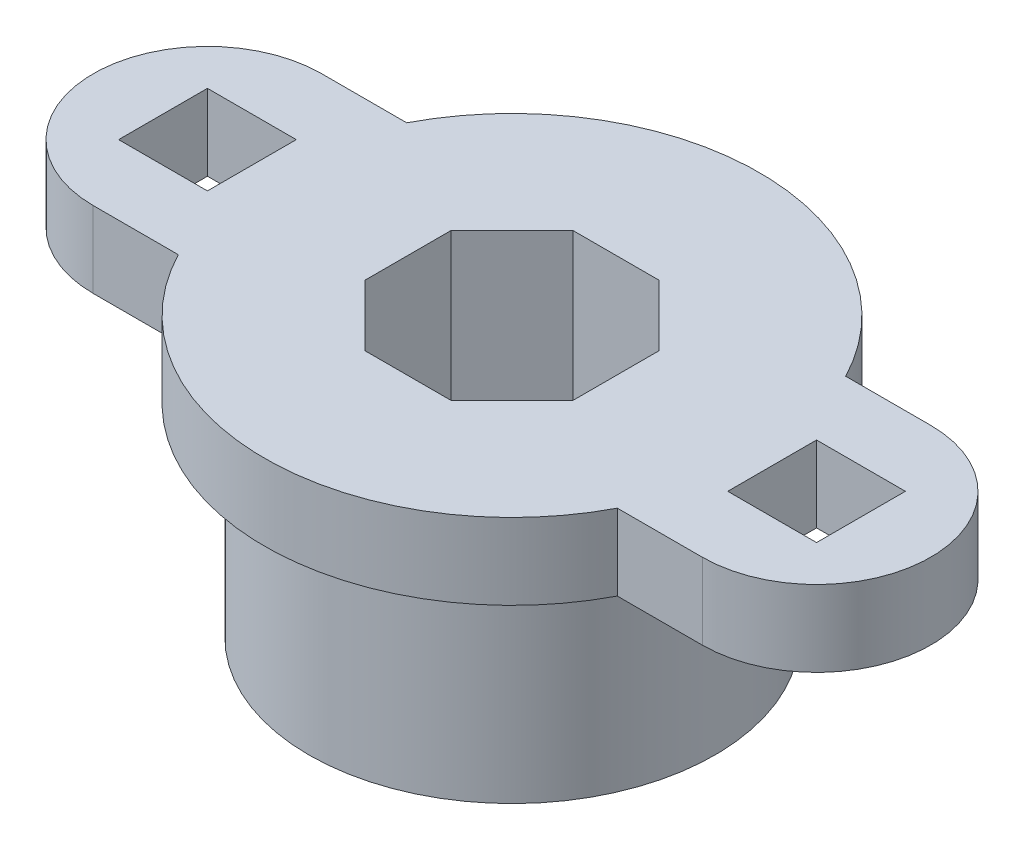
ISO-10303-21;
HEADER;
FILE_DESCRIPTION(('STEP AP214'),'2;1');
FILE_NAME('part.step','',(''),(''),'','','');
FILE_SCHEMA(('AUTOMOTIVE_DESIGN { 1 0 10303 214 1 1 1 1 }'));
ENDSEC;
DATA;
#1=APPLICATION_CONTEXT('core data for automotive mechanical design processes');
#2=APPLICATION_PROTOCOL_DEFINITION('international standard','automotive_design',2000,#1);
#3=PRODUCT_CONTEXT('',#1,'mechanical');
#4=PRODUCT('Part','Part','',(#3));
#5=PRODUCT_RELATED_PRODUCT_CATEGORY('part','',(#4));
#6=PRODUCT_DEFINITION_FORMATION('','',#4);
#7=PRODUCT_DEFINITION_CONTEXT('part definition',#1,'design');
#8=PRODUCT_DEFINITION('design','',#6,#7);
#9=PRODUCT_DEFINITION_SHAPE('','',#8);
#10=(LENGTH_UNIT() NAMED_UNIT(*) SI_UNIT(.MILLI.,.METRE.));
#11=(NAMED_UNIT(*) PLANE_ANGLE_UNIT() SI_UNIT($,.RADIAN.));
#12=(NAMED_UNIT(*) SI_UNIT($,.STERADIAN.) SOLID_ANGLE_UNIT());
#13=UNCERTAINTY_MEASURE_WITH_UNIT(LENGTH_MEASURE(1.E-05),#10,'distance_accuracy_value','');
#14=(GEOMETRIC_REPRESENTATION_CONTEXT(3) GLOBAL_UNCERTAINTY_ASSIGNED_CONTEXT((#13)) GLOBAL_UNIT_ASSIGNED_CONTEXT((#10,
#11,#12)) REPRESENTATION_CONTEXT('',''));
#15=CARTESIAN_POINT('',(0.,0.,0.));
#16=DIRECTION('',(0.,0.,1.));
#17=DIRECTION('',(1.,0.,0.));
#18=AXIS2_PLACEMENT_3D('',#15,#16,#17);
#19=CARTESIAN_POINT('',(0.,11.,0.));
#20=DIRECTION('',(0.,-1.,0.));
#21=DIRECTION('',(0.,0.,-1.));
#22=AXIS2_PLACEMENT_3D('',#19,#20,#21);
#23=CYLINDRICAL_SURFACE('',#22,9.75);
#24=CARTESIAN_POINT('',(0.,11.,0.));
#25=DIRECTION('',(0.,1.,0.));
#26=DIRECTION('',(0.,0.,1.));
#27=AXIS2_PLACEMENT_3D('',#24,#25,#26);
#28=CIRCLE('',#27,9.75);
#29=CARTESIAN_POINT('',(-8.6494219460031,11.,4.5));
#30=VERTEX_POINT('',#29);
#31=CARTESIAN_POINT('',(8.6494219460031,11.,4.5));
#32=VERTEX_POINT('',#31);
#33=EDGE_CURVE('E371',#30,#32,#28,.T.);
#34=ORIENTED_EDGE('',*,*,#33,.F.);
#35=DIRECTION('',(0.,-1.,0.));
#36=VECTOR('',#35,1.);
#37=CARTESIAN_POINT('',(-8.6494219460031,11.,4.5));
#38=LINE('',#37,#36);
#39=CARTESIAN_POINT('',(-8.6494219460031,8.,4.5));
#40=VERTEX_POINT('',#39);
#41=EDGE_CURVE('E367',#30,#40,#38,.T.);
#42=ORIENTED_EDGE('',*,*,#41,.T.);
#43=CARTESIAN_POINT('',(0.,8.,0.));
#44=DIRECTION('',(0.,1.,0.));
#45=DIRECTION('',(0.,0.,1.));
#46=AXIS2_PLACEMENT_3D('',#43,#44,#45);
#47=CIRCLE('',#46,9.75);
#48=CARTESIAN_POINT('',(8.6494219460031,8.,4.5));
#49=VERTEX_POINT('',#48);
#50=EDGE_CURVE('E370',#40,#49,#47,.T.);
#51=ORIENTED_EDGE('',*,*,#50,.T.);
#52=DIRECTION('',(0.,-1.,0.));
#53=VECTOR('',#52,1.);
#54=CARTESIAN_POINT('',(8.6494219460031,11.,4.5));
#55=LINE('',#54,#53);
#56=EDGE_CURVE('E365',#49,#32,#55,.F.);
#57=ORIENTED_EDGE('',*,*,#56,.T.);
#58=EDGE_LOOP('',(#34,#42,#51,#57));
#59=FACE_BOUND('',#58,.T.);
#60=ADVANCED_FACE('F33',(#59),#23,.T.);
#61=CARTESIAN_POINT('',(0.,8.,0.));
#62=DIRECTION('',(0.,-1.,0.));
#63=DIRECTION('',(0.,0.,-1.));
#64=AXIS2_PLACEMENT_3D('',#61,#62,#63);
#65=CYLINDRICAL_SURFACE('',#64,8.);
#66=CARTESIAN_POINT('',(0.,8.,0.));
#67=DIRECTION('',(0.,1.,0.));
#68=DIRECTION('',(0.,0.,1.));
#69=AXIS2_PLACEMENT_3D('',#66,#67,#68);
#70=CIRCLE('',#69,8.);
#71=CARTESIAN_POINT('',(0.,8.,8.));
#72=VERTEX_POINT('',#71);
#73=EDGE_CURVE('E11',#72,#72,#70,.T.);
#74=ORIENTED_EDGE('',*,*,#73,.F.);
#75=EDGE_LOOP('',(#74));
#76=FACE_BOUND('',#75,.T.);
#77=CARTESIAN_POINT('',(0.,0.,0.));
#78=DIRECTION('',(0.,1.,0.));
#79=DIRECTION('',(0.,0.,1.));
#80=AXIS2_PLACEMENT_3D('',#77,#78,#79);
#81=CIRCLE('',#80,8.);
#82=CARTESIAN_POINT('',(0.,0.,8.));
#83=VERTEX_POINT('',#82);
#84=EDGE_CURVE('E37',#83,#83,#81,.T.);
#85=ORIENTED_EDGE('',*,*,#84,.T.);
#86=EDGE_LOOP('',(#85));
#87=FACE_BOUND('',#86,.T.);
#88=ADVANCED_FACE('F35',(#76,#87),#65,.T.);
#89=CARTESIAN_POINT('',(0.,0.,0.));
#90=DIRECTION('',(0.,1.,0.));
#91=DIRECTION('',(0.,0.,1.));
#92=AXIS2_PLACEMENT_3D('',#89,#90,#91);
#93=PLANE('',#92);
#94=DIRECTION('',(0.707106781186547,0.,-0.707106781186548));
#95=VECTOR('',#94,1.);
#96=CARTESIAN_POINT('',(1.69827560572969,0.,4.1));
#97=LINE('',#96,#95);
#98=CARTESIAN_POINT('',(1.69827560572969,0.,4.1));
#99=VERTEX_POINT('',#98);
#100=CARTESIAN_POINT('',(4.1,0.,1.69827560572969));
#101=VERTEX_POINT('',#100);
#102=EDGE_CURVE('E202',#99,#101,#97,.T.);
#103=ORIENTED_EDGE('',*,*,#102,.T.);
#104=DIRECTION('',(0.,0.,-1.));
#105=VECTOR('',#104,1.);
#106=CARTESIAN_POINT('',(4.1,0.,1.69827560572969));
#107=LINE('',#106,#105);
#108=CARTESIAN_POINT('',(4.1,0.,-1.69827560572969));
#109=VERTEX_POINT('',#108);
#110=EDGE_CURVE('E196',#101,#109,#107,.T.);
#111=ORIENTED_EDGE('',*,*,#110,.T.);
#112=DIRECTION('',(-0.707106781186548,0.,-0.707106781186547));
#113=VECTOR('',#112,1.);
#114=CARTESIAN_POINT('',(4.1,0.,-1.69827560572969));
#115=LINE('',#114,#113);
#116=CARTESIAN_POINT('',(1.69827560572969,0.,-4.1));
#117=VERTEX_POINT('',#116);
#118=EDGE_CURVE('E205',#109,#117,#115,.T.);
#119=ORIENTED_EDGE('',*,*,#118,.T.);
#120=DIRECTION('',(-1.,0.,0.));
#121=VECTOR('',#120,1.);
#122=CARTESIAN_POINT('',(1.69827560572969,0.,-4.1));
#123=LINE('',#122,#121);
#124=CARTESIAN_POINT('',(-1.69827560572969,0.,-4.1));
#125=VERTEX_POINT('',#124);
#126=EDGE_CURVE('E48',#117,#125,#123,.T.);
#127=ORIENTED_EDGE('',*,*,#126,.T.);
#128=DIRECTION('',(-0.707106781186547,0.,0.707106781186548));
#129=VECTOR('',#128,1.);
#130=CARTESIAN_POINT('',(-1.69827560572969,0.,-4.1));
#131=LINE('',#130,#129);
#132=CARTESIAN_POINT('',(-4.1,0.,-1.69827560572969));
#133=VERTEX_POINT('',#132);
#134=EDGE_CURVE('E220',#125,#133,#131,.T.);
#135=ORIENTED_EDGE('',*,*,#134,.T.);
#136=DIRECTION('',(0.,0.,1.));
#137=VECTOR('',#136,1.);
#138=CARTESIAN_POINT('',(-4.1,0.,-1.69827560572969));
#139=LINE('',#138,#137);
#140=CARTESIAN_POINT('',(-4.1,0.,1.69827560572969));
#141=VERTEX_POINT('',#140);
#142=EDGE_CURVE('E223',#133,#141,#139,.T.);
#143=ORIENTED_EDGE('',*,*,#142,.T.);
#144=DIRECTION('',(0.707106781186548,0.,0.707106781186547));
#145=VECTOR('',#144,1.);
#146=CARTESIAN_POINT('',(-4.1,0.,1.69827560572969));
#147=LINE('',#146,#145);
#148=CARTESIAN_POINT('',(-1.69827560572969,0.,4.1));
#149=VERTEX_POINT('',#148);
#150=EDGE_CURVE('E226',#141,#149,#147,.T.);
#151=ORIENTED_EDGE('',*,*,#150,.T.);
#152=DIRECTION('',(1.,0.,0.));
#153=VECTOR('',#152,1.);
#154=CARTESIAN_POINT('',(-1.69827560572969,0.,4.1));
#155=LINE('',#154,#153);
#156=EDGE_CURVE('E229',#149,#99,#155,.T.);
#157=ORIENTED_EDGE('',*,*,#156,.T.);
#158=EDGE_LOOP('',(#103,#111,#119,#127,#135,#143,#151,#157));
#159=FACE_BOUND('',#158,.T.);
#160=ORIENTED_EDGE('',*,*,#84,.F.);
#161=EDGE_LOOP('',(#160));
#162=FACE_BOUND('',#161,.T.);
#163=ADVANCED_FACE('F209',(#159,#162),#93,.F.);
#164=CARTESIAN_POINT('',(0.,8.,0.));
#165=DIRECTION('',(0.,1.,0.));
#166=DIRECTION('',(0.,0.,1.));
#167=AXIS2_PLACEMENT_3D('',#164,#165,#166);
#168=PLANE('',#167);
#169=DIRECTION('',(0.,0.,1.));
#170=VECTOR('',#169,1.);
#171=CARTESIAN_POINT('',(13.75,8.,-1.75));
#172=LINE('',#171,#170);
#173=CARTESIAN_POINT('',(13.75,8.,-1.75));
#174=VERTEX_POINT('',#173);
#175=CARTESIAN_POINT('',(13.75,8.,1.75000000000001));
#176=VERTEX_POINT('',#175);
#177=EDGE_CURVE('E264',#174,#176,#172,.T.);
#178=ORIENTED_EDGE('',*,*,#177,.F.);
#179=DIRECTION('',(1.,0.,0.));
#180=VECTOR('',#179,1.);
#181=CARTESIAN_POINT('',(10.25,8.,-1.75));
#182=LINE('',#181,#180);
#183=CARTESIAN_POINT('',(10.25,8.,-1.75));
#184=VERTEX_POINT('',#183);
#185=EDGE_CURVE('E267',#184,#174,#182,.T.);
#186=ORIENTED_EDGE('',*,*,#185,.F.);
#187=DIRECTION('',(0.,0.,-1.));
#188=VECTOR('',#187,1.);
#189=CARTESIAN_POINT('',(10.25,8.,1.75000000000001));
#190=LINE('',#189,#188);
#191=CARTESIAN_POINT('',(10.25,8.,1.75000000000001));
#192=VERTEX_POINT('',#191);
#193=EDGE_CURVE('E284',#192,#184,#190,.T.);
#194=ORIENTED_EDGE('',*,*,#193,.F.);
#195=DIRECTION('',(-1.,0.,0.));
#196=VECTOR('',#195,1.);
#197=CARTESIAN_POINT('',(13.75,8.,1.75000000000001));
#198=LINE('',#197,#196);
#199=EDGE_CURVE('E251',#176,#192,#198,.T.);
#200=ORIENTED_EDGE('',*,*,#199,.F.);
#201=EDGE_LOOP('',(#178,#186,#194,#200));
#202=FACE_BOUND('',#201,.T.);
#203=DIRECTION('',(-1.,0.,0.));
#204=VECTOR('',#203,1.);
#205=CARTESIAN_POINT('',(-13.75,8.,1.75000000000001));
#206=LINE('',#205,#204);
#207=CARTESIAN_POINT('',(-10.25,8.,1.75000000000001));
#208=VERTEX_POINT('',#207);
#209=CARTESIAN_POINT('',(-13.75,8.,1.75000000000001));
#210=VERTEX_POINT('',#209);
#211=EDGE_CURVE('E295',#208,#210,#206,.T.);
#212=ORIENTED_EDGE('',*,*,#211,.F.);
#213=DIRECTION('',(0.,0.,1.));
#214=VECTOR('',#213,1.);
#215=CARTESIAN_POINT('',(-10.25,8.,1.75000000000001));
#216=LINE('',#215,#214);
#217=CARTESIAN_POINT('',(-10.25,8.,-1.75));
#218=VERTEX_POINT('',#217);
#219=EDGE_CURVE('E298',#218,#208,#216,.T.);
#220=ORIENTED_EDGE('',*,*,#219,.F.);
#221=DIRECTION('',(1.,0.,0.));
#222=VECTOR('',#221,1.);
#223=CARTESIAN_POINT('',(-10.25,8.,-1.75));
#224=LINE('',#223,#222);
#225=CARTESIAN_POINT('',(-13.75,8.,-1.75));
#226=VERTEX_POINT('',#225);
#227=EDGE_CURVE('E315',#226,#218,#224,.T.);
#228=ORIENTED_EDGE('',*,*,#227,.F.);
#229=DIRECTION('',(0.,0.,-1.));
#230=VECTOR('',#229,1.);
#231=CARTESIAN_POINT('',(-13.75,8.,-1.75));
#232=LINE('',#231,#230);
#233=EDGE_CURVE('E293',#210,#226,#232,.T.);
#234=ORIENTED_EDGE('',*,*,#233,.F.);
#235=EDGE_LOOP('',(#212,#220,#228,#234));
#236=FACE_BOUND('',#235,.T.);
#237=ORIENTED_EDGE('',*,*,#73,.T.);
#238=EDGE_LOOP('',(#237));
#239=FACE_BOUND('',#238,.T.);
#240=CARTESIAN_POINT('',(8.6494219460031,8.,-4.5));
#241=VERTEX_POINT('',#240);
#242=CARTESIAN_POINT('',(-8.6494219460031,8.,-4.5));
#243=VERTEX_POINT('',#242);
#244=EDGE_CURVE('E375',#241,#243,#47,.T.);
#245=ORIENTED_EDGE('',*,*,#244,.F.);
#246=DIRECTION('',(1.,0.,0.));
#247=VECTOR('',#246,1.);
#248=CARTESIAN_POINT('',(12.,8.,-4.5));
#249=LINE('',#248,#247);
#250=CARTESIAN_POINT('',(12.,8.,-4.5));
#251=VERTEX_POINT('',#250);
#252=EDGE_CURVE('E334',#241,#251,#249,.T.);
#253=ORIENTED_EDGE('',*,*,#252,.T.);
#254=CARTESIAN_POINT('',(12.,8.,0.));
#255=DIRECTION('',(0.,1.,0.));
#256=DIRECTION('',(0.,0.,1.));
#257=AXIS2_PLACEMENT_3D('',#254,#255,#256);
#258=CIRCLE('',#257,4.5);
#259=CARTESIAN_POINT('',(12.,8.,4.5));
#260=VERTEX_POINT('',#259);
#261=EDGE_CURVE('E332',#251,#260,#258,.F.);
#262=ORIENTED_EDGE('',*,*,#261,.T.);
#263=DIRECTION('',(-1.,0.,0.));
#264=VECTOR('',#263,1.);
#265=CARTESIAN_POINT('',(12.,8.,4.5));
#266=LINE('',#265,#264);
#267=EDGE_CURVE('E329',#260,#49,#266,.T.);
#268=ORIENTED_EDGE('',*,*,#267,.T.);
#269=ORIENTED_EDGE('',*,*,#50,.F.);
#270=CARTESIAN_POINT('',(-12.,8.,4.5));
#271=VERTEX_POINT('',#270);
#272=EDGE_CURVE('E327',#40,#271,#266,.T.);
#273=ORIENTED_EDGE('',*,*,#272,.T.);
#274=CARTESIAN_POINT('',(-12.,8.,0.));
#275=DIRECTION('',(0.,1.,0.));
#276=DIRECTION('',(0.,0.,1.));
#277=AXIS2_PLACEMENT_3D('',#274,#275,#276);
#278=CIRCLE('',#277,4.5);
#279=CARTESIAN_POINT('',(-12.,8.,-4.5));
#280=VERTEX_POINT('',#279);
#281=EDGE_CURVE('E325',#271,#280,#278,.F.);
#282=ORIENTED_EDGE('',*,*,#281,.T.);
#283=EDGE_CURVE('E357',#280,#243,#249,.T.);
#284=ORIENTED_EDGE('',*,*,#283,.T.);
#285=EDGE_LOOP('',(#245,#253,#262,#268,#269,#273,#282,#284));
#286=FACE_BOUND('',#285,.T.);
#287=ADVANCED_FACE('F389',(#202,#236,#239,#286),#168,.F.);
#288=CARTESIAN_POINT('',(8.6494219460031,11.,-4.5));
#289=VERTEX_POINT('',#288);
#290=CARTESIAN_POINT('',(-8.6494219460031,11.,-4.5));
#291=VERTEX_POINT('',#290);
#292=EDGE_CURVE('E374',#289,#291,#28,.T.);
#293=ORIENTED_EDGE('',*,*,#292,.F.);
#294=DIRECTION('',(0.,-1.,0.));
#295=VECTOR('',#294,1.);
#296=CARTESIAN_POINT('',(8.6494219460031,11.,-4.5));
#297=LINE('',#296,#295);
#298=EDGE_CURVE('E362',#289,#241,#297,.T.);
#299=ORIENTED_EDGE('',*,*,#298,.T.);
#300=ORIENTED_EDGE('',*,*,#244,.T.);
#301=DIRECTION('',(0.,-1.,0.));
#302=VECTOR('',#301,1.);
#303=CARTESIAN_POINT('',(-8.6494219460031,11.,-4.5));
#304=LINE('',#303,#302);
#305=EDGE_CURVE('E360',#243,#291,#304,.F.);
#306=ORIENTED_EDGE('',*,*,#305,.T.);
#307=EDGE_LOOP('',(#293,#299,#300,#306));
#308=FACE_BOUND('',#307,.T.);
#309=ADVANCED_FACE('F380',(#308),#23,.T.);
#310=CARTESIAN_POINT('',(0.,11.,0.));
#311=DIRECTION('',(0.,1.,0.));
#312=DIRECTION('',(0.,0.,1.));
#313=AXIS2_PLACEMENT_3D('',#310,#311,#312);
#314=PLANE('',#313);
#315=DIRECTION('',(0.,0.,-1.));
#316=VECTOR('',#315,1.);
#317=CARTESIAN_POINT('',(4.1,11.,1.69827560572969));
#318=LINE('',#317,#316);
#319=CARTESIAN_POINT('',(4.1,11.,1.69827560572969));
#320=VERTEX_POINT('',#319);
#321=CARTESIAN_POINT('',(4.1,11.,-1.69827560572969));
#322=VERTEX_POINT('',#321);
#323=EDGE_CURVE('E56',#320,#322,#318,.T.);
#324=ORIENTED_EDGE('',*,*,#323,.F.);
#325=DIRECTION('',(0.707106781186547,0.,-0.707106781186548));
#326=VECTOR('',#325,1.);
#327=CARTESIAN_POINT('',(1.69827560572969,11.,4.1));
#328=LINE('',#327,#326);
#329=CARTESIAN_POINT('',(1.69827560572969,11.,4.1));
#330=VERTEX_POINT('',#329);
#331=EDGE_CURVE('E213',#330,#320,#328,.T.);
#332=ORIENTED_EDGE('',*,*,#331,.F.);
#333=DIRECTION('',(1.,0.,0.));
#334=VECTOR('',#333,1.);
#335=CARTESIAN_POINT('',(-1.69827560572969,11.,4.1));
#336=LINE('',#335,#334);
#337=CARTESIAN_POINT('',(-1.69827560572969,11.,4.1));
#338=VERTEX_POINT('',#337);
#339=EDGE_CURVE('E216',#338,#330,#336,.T.);
#340=ORIENTED_EDGE('',*,*,#339,.F.);
#341=DIRECTION('',(0.707106781186548,0.,0.707106781186547));
#342=VECTOR('',#341,1.);
#343=CARTESIAN_POINT('',(-4.1,11.,1.69827560572969));
#344=LINE('',#343,#342);
#345=CARTESIAN_POINT('',(-4.1,11.,1.69827560572969));
#346=VERTEX_POINT('',#345);
#347=EDGE_CURVE('E244',#346,#338,#344,.T.);
#348=ORIENTED_EDGE('',*,*,#347,.F.);
#349=DIRECTION('',(0.,0.,1.));
#350=VECTOR('',#349,1.);
#351=CARTESIAN_POINT('',(-4.1,11.,-1.69827560572969));
#352=LINE('',#351,#350);
#353=CARTESIAN_POINT('',(-4.1,11.,-1.69827560572969));
#354=VERTEX_POINT('',#353);
#355=EDGE_CURVE('E241',#354,#346,#352,.T.);
#356=ORIENTED_EDGE('',*,*,#355,.F.);
#357=DIRECTION('',(-0.707106781186547,0.,0.707106781186548));
#358=VECTOR('',#357,1.);
#359=CARTESIAN_POINT('',(-1.69827560572969,11.,-4.1));
#360=LINE('',#359,#358);
#361=CARTESIAN_POINT('',(-1.69827560572969,11.,-4.1));
#362=VERTEX_POINT('',#361);
#363=EDGE_CURVE('E238',#362,#354,#360,.T.);
#364=ORIENTED_EDGE('',*,*,#363,.F.);
#365=DIRECTION('',(-1.,0.,0.));
#366=VECTOR('',#365,1.);
#367=CARTESIAN_POINT('',(1.69827560572969,11.,-4.1));
#368=LINE('',#367,#366);
#369=CARTESIAN_POINT('',(1.69827560572969,11.,-4.1));
#370=VERTEX_POINT('',#369);
#371=EDGE_CURVE('E235',#370,#362,#368,.T.);
#372=ORIENTED_EDGE('',*,*,#371,.F.);
#373=DIRECTION('',(-0.707106781186548,0.,-0.707106781186547));
#374=VECTOR('',#373,1.);
#375=CARTESIAN_POINT('',(4.1,11.,-1.69827560572969));
#376=LINE('',#375,#374);
#377=EDGE_CURVE('E233',#322,#370,#376,.T.);
#378=ORIENTED_EDGE('',*,*,#377,.F.);
#379=EDGE_LOOP('',(#324,#332,#340,#348,#356,#364,#372,#378));
#380=FACE_BOUND('',#379,.T.);
#381=DIRECTION('',(-1.,0.,0.));
#382=VECTOR('',#381,1.);
#383=CARTESIAN_POINT('',(10.25,11.,-1.75));
#384=LINE('',#383,#382);
#385=CARTESIAN_POINT('',(13.75,11.,-1.75));
#386=VERTEX_POINT('',#385);
#387=CARTESIAN_POINT('',(10.25,11.,-1.75));
#388=VERTEX_POINT('',#387);
#389=EDGE_CURVE('E270',#386,#388,#384,.T.);
#390=ORIENTED_EDGE('',*,*,#389,.F.);
#391=DIRECTION('',(0.,0.,-1.));
#392=VECTOR('',#391,1.);
#393=CARTESIAN_POINT('',(13.75,11.,-1.75));
#394=LINE('',#393,#392);
#395=CARTESIAN_POINT('',(13.75,11.,1.75000000000001));
#396=VERTEX_POINT('',#395);
#397=EDGE_CURVE('E278',#396,#386,#394,.T.);
#398=ORIENTED_EDGE('',*,*,#397,.F.);
#399=DIRECTION('',(1.,0.,0.));
#400=VECTOR('',#399,1.);
#401=CARTESIAN_POINT('',(13.75,11.,1.75000000000001));
#402=LINE('',#401,#400);
#403=CARTESIAN_POINT('',(10.25,11.,1.75000000000001));
#404=VERTEX_POINT('',#403);
#405=EDGE_CURVE('E275',#404,#396,#402,.T.);
#406=ORIENTED_EDGE('',*,*,#405,.F.);
#407=DIRECTION('',(0.,0.,1.));
#408=VECTOR('',#407,1.);
#409=CARTESIAN_POINT('',(10.25,11.,1.75000000000001));
#410=LINE('',#409,#408);
#411=EDGE_CURVE('E272',#388,#404,#410,.T.);
#412=ORIENTED_EDGE('',*,*,#411,.F.);
#413=EDGE_LOOP('',(#390,#398,#406,#412));
#414=FACE_BOUND('',#413,.T.);
#415=DIRECTION('',(0.,0.,-1.));
#416=VECTOR('',#415,1.);
#417=CARTESIAN_POINT('',(-10.25,11.,1.75000000000001));
#418=LINE('',#417,#416);
#419=CARTESIAN_POINT('',(-10.25,11.,1.75000000000001));
#420=VERTEX_POINT('',#419);
#421=CARTESIAN_POINT('',(-10.25,11.,-1.75));
#422=VERTEX_POINT('',#421);
#423=EDGE_CURVE('E301',#420,#422,#418,.T.);
#424=ORIENTED_EDGE('',*,*,#423,.F.);
#425=DIRECTION('',(1.,0.,0.));
#426=VECTOR('',#425,1.);
#427=CARTESIAN_POINT('',(-13.75,11.,1.75000000000001));
#428=LINE('',#427,#426);
#429=CARTESIAN_POINT('',(-13.75,11.,1.75000000000001));
#430=VERTEX_POINT('',#429);
#431=EDGE_CURVE('E309',#430,#420,#428,.T.);
#432=ORIENTED_EDGE('',*,*,#431,.F.);
#433=DIRECTION('',(0.,0.,1.));
#434=VECTOR('',#433,1.);
#435=CARTESIAN_POINT('',(-13.75,11.,-1.75));
#436=LINE('',#435,#434);
#437=CARTESIAN_POINT('',(-13.75,11.,-1.75));
#438=VERTEX_POINT('',#437);
#439=EDGE_CURVE('E306',#438,#430,#436,.T.);
#440=ORIENTED_EDGE('',*,*,#439,.F.);
#441=DIRECTION('',(-1.,0.,0.));
#442=VECTOR('',#441,1.);
#443=CARTESIAN_POINT('',(-10.25,11.,-1.75));
#444=LINE('',#443,#442);
#445=EDGE_CURVE('E303',#422,#438,#444,.T.);
#446=ORIENTED_EDGE('',*,*,#445,.F.);
#447=EDGE_LOOP('',(#424,#432,#440,#446));
#448=FACE_BOUND('',#447,.T.);
#449=ORIENTED_EDGE('',*,*,#292,.T.);
#450=DIRECTION('',(-1.,0.,0.));
#451=VECTOR('',#450,1.);
#452=CARTESIAN_POINT('',(12.,11.,-4.5));
#453=LINE('',#452,#451);
#454=CARTESIAN_POINT('',(-12.,11.,-4.5));
#455=VERTEX_POINT('',#454);
#456=EDGE_CURVE('E337',#291,#455,#453,.T.);
#457=ORIENTED_EDGE('',*,*,#456,.T.);
#458=CARTESIAN_POINT('',(-12.,11.,0.));
#459=DIRECTION('',(0.,1.,0.));
#460=DIRECTION('',(0.,0.,1.));
#461=AXIS2_PLACEMENT_3D('',#458,#459,#460);
#462=CIRCLE('',#461,4.5);
#463=CARTESIAN_POINT('',(-12.,11.,4.5));
#464=VERTEX_POINT('',#463);
#465=EDGE_CURVE('E341',#455,#464,#462,.T.);
#466=ORIENTED_EDGE('',*,*,#465,.T.);
#467=DIRECTION('',(1.,0.,0.));
#468=VECTOR('',#467,1.);
#469=CARTESIAN_POINT('',(12.,11.,4.5));
#470=LINE('',#469,#468);
#471=EDGE_CURVE('E345',#464,#30,#470,.T.);
#472=ORIENTED_EDGE('',*,*,#471,.T.);
#473=ORIENTED_EDGE('',*,*,#33,.T.);
#474=CARTESIAN_POINT('',(12.,11.,4.5));
#475=VERTEX_POINT('',#474);
#476=EDGE_CURVE('E344',#32,#475,#470,.T.);
#477=ORIENTED_EDGE('',*,*,#476,.T.);
#478=CARTESIAN_POINT('',(12.,11.,0.));
#479=DIRECTION('',(0.,1.,0.));
#480=DIRECTION('',(0.,0.,1.));
#481=AXIS2_PLACEMENT_3D('',#478,#479,#480);
#482=CIRCLE('',#481,4.5);
#483=CARTESIAN_POINT('',(12.,11.,-4.5));
#484=VERTEX_POINT('',#483);
#485=EDGE_CURVE('E324',#475,#484,#482,.T.);
#486=ORIENTED_EDGE('',*,*,#485,.T.);
#487=EDGE_CURVE('E338',#484,#289,#453,.T.);
#488=ORIENTED_EDGE('',*,*,#487,.T.);
#489=EDGE_LOOP('',(#449,#457,#466,#472,#473,#477,#486,#488));
#490=FACE_BOUND('',#489,.T.);
#491=ADVANCED_FACE('F399',(#380,#414,#448,#490),#314,.T.);
#492=CARTESIAN_POINT('',(-12.,-26.2052627529741,0.));
#493=DIRECTION('',(0.,1.,0.));
#494=DIRECTION('',(0.,0.,1.));
#495=AXIS2_PLACEMENT_3D('',#492,#493,#494);
#496=CYLINDRICAL_SURFACE('',#495,4.5);
#497=ORIENTED_EDGE('',*,*,#281,.F.);
#498=DIRECTION('',(0.,1.,0.));
#499=VECTOR('',#498,1.);
#500=CARTESIAN_POINT('',(-12.,-26.2052627529741,4.5));
#501=LINE('',#500,#499);
#502=EDGE_CURVE('E351',#271,#464,#501,.T.);
#503=ORIENTED_EDGE('',*,*,#502,.T.);
#504=ORIENTED_EDGE('',*,*,#465,.F.);
#505=DIRECTION('',(0.,1.,0.));
#506=VECTOR('',#505,1.);
#507=CARTESIAN_POINT('',(-12.,-26.2052627529741,-4.5));
#508=LINE('',#507,#506);
#509=EDGE_CURVE('E353',#280,#455,#508,.T.);
#510=ORIENTED_EDGE('',*,*,#509,.F.);
#511=EDGE_LOOP('',(#497,#503,#504,#510));
#512=FACE_BOUND('',#511,.T.);
#513=ADVANCED_FACE('F396',(#512),#496,.T.);
#514=CARTESIAN_POINT('',(12.,-26.2052627529741,-4.5));
#515=DIRECTION('',(0.,0.,-1.));
#516=DIRECTION('',(-1.,0.,0.));
#517=AXIS2_PLACEMENT_3D('',#514,#515,#516);
#518=PLANE('',#517);
#519=ORIENTED_EDGE('',*,*,#305,.F.);
#520=ORIENTED_EDGE('',*,*,#283,.F.);
#521=ORIENTED_EDGE('',*,*,#509,.T.);
#522=ORIENTED_EDGE('',*,*,#456,.F.);
#523=EDGE_LOOP('',(#519,#520,#521,#522));
#524=FACE_BOUND('',#523,.T.);
#525=ADVANCED_FACE('F388',(#524),#518,.T.);
#526=CARTESIAN_POINT('',(12.,-26.2052627529741,4.5));
#527=DIRECTION('',(0.,0.,1.));
#528=DIRECTION('',(1.,0.,0.));
#529=AXIS2_PLACEMENT_3D('',#526,#527,#528);
#530=PLANE('',#529);
#531=ORIENTED_EDGE('',*,*,#41,.F.);
#532=ORIENTED_EDGE('',*,*,#471,.F.);
#533=ORIENTED_EDGE('',*,*,#502,.F.);
#534=ORIENTED_EDGE('',*,*,#272,.F.);
#535=EDGE_LOOP('',(#531,#532,#533,#534));
#536=FACE_BOUND('',#535,.T.);
#537=ADVANCED_FACE('F402',(#536),#530,.T.);
#538=ORIENTED_EDGE('',*,*,#56,.F.);
#539=ORIENTED_EDGE('',*,*,#267,.F.);
#540=DIRECTION('',(0.,1.,0.));
#541=VECTOR('',#540,1.);
#542=CARTESIAN_POINT('',(12.,-26.2052627529741,4.5));
#543=LINE('',#542,#541);
#544=EDGE_CURVE('E328',#260,#475,#543,.T.);
#545=ORIENTED_EDGE('',*,*,#544,.T.);
#546=ORIENTED_EDGE('',*,*,#476,.F.);
#547=EDGE_LOOP('',(#538,#539,#545,#546));
#548=FACE_BOUND('',#547,.T.);
#549=ADVANCED_FACE('F405',(#548),#530,.T.);
#550=ORIENTED_EDGE('',*,*,#298,.F.);
#551=ORIENTED_EDGE('',*,*,#487,.F.);
#552=DIRECTION('',(0.,1.,0.));
#553=VECTOR('',#552,1.);
#554=CARTESIAN_POINT('',(12.,-26.2052627529741,-4.5));
#555=LINE('',#554,#553);
#556=EDGE_CURVE('E348',#251,#484,#555,.T.);
#557=ORIENTED_EDGE('',*,*,#556,.F.);
#558=ORIENTED_EDGE('',*,*,#252,.F.);
#559=EDGE_LOOP('',(#550,#551,#557,#558));
#560=FACE_BOUND('',#559,.T.);
#561=ADVANCED_FACE('F415',(#560),#518,.T.);
#562=CARTESIAN_POINT('',(12.,-26.2052627529741,0.));
#563=DIRECTION('',(0.,1.,0.));
#564=DIRECTION('',(0.,0.,1.));
#565=AXIS2_PLACEMENT_3D('',#562,#563,#564);
#566=CYLINDRICAL_SURFACE('',#565,4.5);
#567=ORIENTED_EDGE('',*,*,#261,.F.);
#568=ORIENTED_EDGE('',*,*,#556,.T.);
#569=ORIENTED_EDGE('',*,*,#485,.F.);
#570=ORIENTED_EDGE('',*,*,#544,.F.);
#571=EDGE_LOOP('',(#567,#568,#569,#570));
#572=FACE_BOUND('',#571,.T.);
#573=ADVANCED_FACE('F411',(#572),#566,.T.);
#574=CARTESIAN_POINT('',(-10.25,-0.000999999999999265,1.75000000000001));
#575=DIRECTION('',(1.,0.,0.));
#576=DIRECTION('',(0.,0.,-1.));
#577=AXIS2_PLACEMENT_3D('',#574,#575,#576);
#578=PLANE('',#577);
#579=ORIENTED_EDGE('',*,*,#219,.T.);
#580=DIRECTION('',(0.,1.,0.));
#581=VECTOR('',#580,1.);
#582=CARTESIAN_POINT('',(-10.25,-0.000999999999999265,1.75000000000001));
#583=LINE('',#582,#581);
#584=EDGE_CURVE('E313',#208,#420,#583,.T.);
#585=ORIENTED_EDGE('',*,*,#584,.T.);
#586=ORIENTED_EDGE('',*,*,#423,.T.);
#587=DIRECTION('',(0.,1.,0.));
#588=VECTOR('',#587,1.);
#589=CARTESIAN_POINT('',(-10.25,-0.000999999999999265,-1.75));
#590=LINE('',#589,#588);
#591=EDGE_CURVE('E312',#218,#422,#590,.T.);
#592=ORIENTED_EDGE('',*,*,#591,.F.);
#593=EDGE_LOOP('',(#579,#585,#586,#592));
#594=FACE_BOUND('',#593,.T.);
#595=ADVANCED_FACE('F422',(#594),#578,.F.);
#596=CARTESIAN_POINT('',(-13.75,-0.000999999999999265,1.75000000000001));
#597=DIRECTION('',(0.,0.,1.));
#598=DIRECTION('',(1.,0.,0.));
#599=AXIS2_PLACEMENT_3D('',#596,#597,#598);
#600=PLANE('',#599);
#601=ORIENTED_EDGE('',*,*,#211,.T.);
#602=DIRECTION('',(0.,1.,0.));
#603=VECTOR('',#602,1.);
#604=CARTESIAN_POINT('',(-13.75,-0.000999999999999265,1.75000000000001));
#605=LINE('',#604,#603);
#606=EDGE_CURVE('E316',#210,#430,#605,.T.);
#607=ORIENTED_EDGE('',*,*,#606,.T.);
#608=ORIENTED_EDGE('',*,*,#431,.T.);
#609=ORIENTED_EDGE('',*,*,#584,.F.);
#610=EDGE_LOOP('',(#601,#607,#608,#609));
#611=FACE_BOUND('',#610,.T.);
#612=ADVANCED_FACE('F459',(#611),#600,.F.);
#613=CARTESIAN_POINT('',(-13.75,-0.000999999999999265,-1.75));
#614=DIRECTION('',(-1.,0.,0.));
#615=DIRECTION('',(0.,0.,1.));
#616=AXIS2_PLACEMENT_3D('',#613,#614,#615);
#617=PLANE('',#616);
#618=ORIENTED_EDGE('',*,*,#233,.T.);
#619=DIRECTION('',(0.,1.,0.));
#620=VECTOR('',#619,1.);
#621=CARTESIAN_POINT('',(-13.75,-0.000999999999999265,-1.75));
#622=LINE('',#621,#620);
#623=EDGE_CURVE('E318',#226,#438,#622,.T.);
#624=ORIENTED_EDGE('',*,*,#623,.T.);
#625=ORIENTED_EDGE('',*,*,#439,.T.);
#626=ORIENTED_EDGE('',*,*,#606,.F.);
#627=EDGE_LOOP('',(#618,#624,#625,#626));
#628=FACE_BOUND('',#627,.T.);
#629=ADVANCED_FACE('F469',(#628),#617,.F.);
#630=CARTESIAN_POINT('',(-10.25,-0.000999999999999265,-1.75));
#631=DIRECTION('',(0.,0.,-1.));
#632=DIRECTION('',(-1.,0.,0.));
#633=AXIS2_PLACEMENT_3D('',#630,#631,#632);
#634=PLANE('',#633);
#635=ORIENTED_EDGE('',*,*,#227,.T.);
#636=ORIENTED_EDGE('',*,*,#591,.T.);
#637=ORIENTED_EDGE('',*,*,#445,.T.);
#638=ORIENTED_EDGE('',*,*,#623,.F.);
#639=EDGE_LOOP('',(#635,#636,#637,#638));
#640=FACE_BOUND('',#639,.T.);
#641=ADVANCED_FACE('F466',(#640),#634,.F.);
#642=CARTESIAN_POINT('',(10.25,-0.000999999999999265,-1.75));
#643=DIRECTION('',(0.,0.,-1.));
#644=DIRECTION('',(-1.,0.,0.));
#645=AXIS2_PLACEMENT_3D('',#642,#643,#644);
#646=PLANE('',#645);
#647=ORIENTED_EDGE('',*,*,#185,.T.);
#648=DIRECTION('',(0.,1.,0.));
#649=VECTOR('',#648,1.);
#650=CARTESIAN_POINT('',(13.75,-0.000999999999999265,-1.75));
#651=LINE('',#650,#649);
#652=EDGE_CURVE('E282',#174,#386,#651,.T.);
#653=ORIENTED_EDGE('',*,*,#652,.T.);
#654=ORIENTED_EDGE('',*,*,#389,.T.);
#655=DIRECTION('',(0.,1.,0.));
#656=VECTOR('',#655,1.);
#657=CARTESIAN_POINT('',(10.25,-0.000999999999999265,-1.75));
#658=LINE('',#657,#656);
#659=EDGE_CURVE('E281',#184,#388,#658,.T.);
#660=ORIENTED_EDGE('',*,*,#659,.F.);
#661=EDGE_LOOP('',(#647,#653,#654,#660));
#662=FACE_BOUND('',#661,.T.);
#663=ADVANCED_FACE('F477',(#662),#646,.F.);
#664=CARTESIAN_POINT('',(13.75,-0.000999999999999265,-1.75));
#665=DIRECTION('',(1.,0.,0.));
#666=DIRECTION('',(0.,0.,-1.));
#667=AXIS2_PLACEMENT_3D('',#664,#665,#666);
#668=PLANE('',#667);
#669=ORIENTED_EDGE('',*,*,#177,.T.);
#670=DIRECTION('',(0.,1.,0.));
#671=VECTOR('',#670,1.);
#672=CARTESIAN_POINT('',(13.75,-0.000999999999999265,1.75000000000001));
#673=LINE('',#672,#671);
#674=EDGE_CURVE('E285',#176,#396,#673,.T.);
#675=ORIENTED_EDGE('',*,*,#674,.T.);
#676=ORIENTED_EDGE('',*,*,#397,.T.);
#677=ORIENTED_EDGE('',*,*,#652,.F.);
#678=EDGE_LOOP('',(#669,#675,#676,#677));
#679=FACE_BOUND('',#678,.T.);
#680=ADVANCED_FACE('F549',(#679),#668,.F.);
#681=CARTESIAN_POINT('',(13.75,-0.000999999999999265,1.75000000000001));
#682=DIRECTION('',(0.,0.,1.));
#683=DIRECTION('',(1.,0.,0.));
#684=AXIS2_PLACEMENT_3D('',#681,#682,#683);
#685=PLANE('',#684);
#686=ORIENTED_EDGE('',*,*,#199,.T.);
#687=DIRECTION('',(0.,1.,0.));
#688=VECTOR('',#687,1.);
#689=CARTESIAN_POINT('',(10.25,-0.000999999999999265,1.75000000000001));
#690=LINE('',#689,#688);
#691=EDGE_CURVE('E287',#192,#404,#690,.T.);
#692=ORIENTED_EDGE('',*,*,#691,.T.);
#693=ORIENTED_EDGE('',*,*,#405,.T.);
#694=ORIENTED_EDGE('',*,*,#674,.F.);
#695=EDGE_LOOP('',(#686,#692,#693,#694));
#696=FACE_BOUND('',#695,.T.);
#697=ADVANCED_FACE('F558',(#696),#685,.F.);
#698=CARTESIAN_POINT('',(10.25,-0.000999999999999265,1.75000000000001));
#699=DIRECTION('',(-1.,0.,0.));
#700=DIRECTION('',(0.,0.,1.));
#701=AXIS2_PLACEMENT_3D('',#698,#699,#700);
#702=PLANE('',#701);
#703=ORIENTED_EDGE('',*,*,#193,.T.);
#704=ORIENTED_EDGE('',*,*,#659,.T.);
#705=ORIENTED_EDGE('',*,*,#411,.T.);
#706=ORIENTED_EDGE('',*,*,#691,.F.);
#707=EDGE_LOOP('',(#703,#704,#705,#706));
#708=FACE_BOUND('',#707,.T.);
#709=ADVANCED_FACE('F568',(#708),#702,.F.);
#710=CARTESIAN_POINT('',(4.1,0.,1.69827560572969));
#711=DIRECTION('',(1.,0.,0.));
#712=DIRECTION('',(0.,0.,-1.));
#713=AXIS2_PLACEMENT_3D('',#710,#711,#712);
#714=PLANE('',#713);
#715=ORIENTED_EDGE('',*,*,#323,.T.);
#716=DIRECTION('',(0.,1.,0.));
#717=VECTOR('',#716,1.);
#718=CARTESIAN_POINT('',(4.1,0.,-1.69827560572969));
#719=LINE('',#718,#717);
#720=EDGE_CURVE('E192',#109,#322,#719,.T.);
#721=ORIENTED_EDGE('',*,*,#720,.F.);
#722=ORIENTED_EDGE('',*,*,#110,.F.);
#723=DIRECTION('',(0.,1.,0.));
#724=VECTOR('',#723,1.);
#725=CARTESIAN_POINT('',(4.1,0.,1.69827560572969));
#726=LINE('',#725,#724);
#727=EDGE_CURVE('E249',#101,#320,#726,.T.);
#728=ORIENTED_EDGE('',*,*,#727,.T.);
#729=EDGE_LOOP('',(#715,#721,#722,#728));
#730=FACE_BOUND('',#729,.T.);
#731=ADVANCED_FACE('F194',(#730),#714,.F.);
#732=CARTESIAN_POINT('',(1.69827560572969,0.,4.1));
#733=DIRECTION('',(0.707106781186548,0.,0.707106781186547));
#734=DIRECTION('',(0.707106781186547,0.,-0.707106781186548));
#735=AXIS2_PLACEMENT_3D('',#732,#733,#734);
#736=PLANE('',#735);
#737=ORIENTED_EDGE('',*,*,#331,.T.);
#738=ORIENTED_EDGE('',*,*,#727,.F.);
#739=ORIENTED_EDGE('',*,*,#102,.F.);
#740=DIRECTION('',(0.,1.,0.));
#741=VECTOR('',#740,1.);
#742=CARTESIAN_POINT('',(1.69827560572969,0.,4.1));
#743=LINE('',#742,#741);
#744=EDGE_CURVE('E252',#99,#330,#743,.T.);
#745=ORIENTED_EDGE('',*,*,#744,.T.);
#746=EDGE_LOOP('',(#737,#738,#739,#745));
#747=FACE_BOUND('',#746,.T.);
#748=ADVANCED_FACE('F598',(#747),#736,.F.);
#749=CARTESIAN_POINT('',(-1.69827560572969,0.,4.1));
#750=DIRECTION('',(0.,0.,1.));
#751=DIRECTION('',(1.,0.,0.));
#752=AXIS2_PLACEMENT_3D('',#749,#750,#751);
#753=PLANE('',#752);
#754=ORIENTED_EDGE('',*,*,#339,.T.);
#755=ORIENTED_EDGE('',*,*,#744,.F.);
#756=ORIENTED_EDGE('',*,*,#156,.F.);
#757=DIRECTION('',(0.,1.,0.));
#758=VECTOR('',#757,1.);
#759=CARTESIAN_POINT('',(-1.69827560572969,0.,4.1));
#760=LINE('',#759,#758);
#761=EDGE_CURVE('E254',#149,#338,#760,.T.);
#762=ORIENTED_EDGE('',*,*,#761,.T.);
#763=EDGE_LOOP('',(#754,#755,#756,#762));
#764=FACE_BOUND('',#763,.T.);
#765=ADVANCED_FACE('F607',(#764),#753,.F.);
#766=CARTESIAN_POINT('',(-4.1,0.,1.69827560572969));
#767=DIRECTION('',(-0.707106781186547,0.,0.707106781186548));
#768=DIRECTION('',(0.707106781186548,0.,0.707106781186547));
#769=AXIS2_PLACEMENT_3D('',#766,#767,#768);
#770=PLANE('',#769);
#771=ORIENTED_EDGE('',*,*,#347,.T.);
#772=ORIENTED_EDGE('',*,*,#761,.F.);
#773=ORIENTED_EDGE('',*,*,#150,.F.);
#774=DIRECTION('',(0.,1.,0.));
#775=VECTOR('',#774,1.);
#776=CARTESIAN_POINT('',(-4.1,0.,1.69827560572969));
#777=LINE('',#776,#775);
#778=EDGE_CURVE('E256',#141,#346,#777,.T.);
#779=ORIENTED_EDGE('',*,*,#778,.T.);
#780=EDGE_LOOP('',(#771,#772,#773,#779));
#781=FACE_BOUND('',#780,.T.);
#782=ADVANCED_FACE('F617',(#781),#770,.F.);
#783=CARTESIAN_POINT('',(-4.1,0.,-1.69827560572969));
#784=DIRECTION('',(-1.,0.,0.));
#785=DIRECTION('',(0.,0.,1.));
#786=AXIS2_PLACEMENT_3D('',#783,#784,#785);
#787=PLANE('',#786);
#788=ORIENTED_EDGE('',*,*,#355,.T.);
#789=ORIENTED_EDGE('',*,*,#778,.F.);
#790=ORIENTED_EDGE('',*,*,#142,.F.);
#791=DIRECTION('',(0.,1.,0.));
#792=VECTOR('',#791,1.);
#793=CARTESIAN_POINT('',(-4.1,0.,-1.69827560572969));
#794=LINE('',#793,#792);
#795=EDGE_CURVE('E258',#133,#354,#794,.T.);
#796=ORIENTED_EDGE('',*,*,#795,.T.);
#797=EDGE_LOOP('',(#788,#789,#790,#796));
#798=FACE_BOUND('',#797,.T.);
#799=ADVANCED_FACE('F627',(#798),#787,.F.);
#800=CARTESIAN_POINT('',(-1.69827560572969,0.,-4.1));
#801=DIRECTION('',(-0.707106781186548,0.,-0.707106781186547));
#802=DIRECTION('',(-0.707106781186547,0.,0.707106781186548));
#803=AXIS2_PLACEMENT_3D('',#800,#801,#802);
#804=PLANE('',#803);
#805=ORIENTED_EDGE('',*,*,#363,.T.);
#806=ORIENTED_EDGE('',*,*,#795,.F.);
#807=ORIENTED_EDGE('',*,*,#134,.F.);
#808=DIRECTION('',(0.,1.,0.));
#809=VECTOR('',#808,1.);
#810=CARTESIAN_POINT('',(-1.69827560572969,0.,-4.1));
#811=LINE('',#810,#809);
#812=EDGE_CURVE('E260',#125,#362,#811,.T.);
#813=ORIENTED_EDGE('',*,*,#812,.T.);
#814=EDGE_LOOP('',(#805,#806,#807,#813));
#815=FACE_BOUND('',#814,.T.);
#816=ADVANCED_FACE('F637',(#815),#804,.F.);
#817=CARTESIAN_POINT('',(1.69827560572969,0.,-4.1));
#818=DIRECTION('',(0.,0.,-1.));
#819=DIRECTION('',(-1.,0.,0.));
#820=AXIS2_PLACEMENT_3D('',#817,#818,#819);
#821=PLANE('',#820);
#822=ORIENTED_EDGE('',*,*,#371,.T.);
#823=ORIENTED_EDGE('',*,*,#812,.F.);
#824=ORIENTED_EDGE('',*,*,#126,.F.);
#825=DIRECTION('',(0.,1.,0.));
#826=VECTOR('',#825,1.);
#827=CARTESIAN_POINT('',(1.69827560572969,0.,-4.1));
#828=LINE('',#827,#826);
#829=EDGE_CURVE('E201',#117,#370,#828,.T.);
#830=ORIENTED_EDGE('',*,*,#829,.T.);
#831=EDGE_LOOP('',(#822,#823,#824,#830));
#832=FACE_BOUND('',#831,.T.);
#833=ADVANCED_FACE('F647',(#832),#821,.F.);
#834=CARTESIAN_POINT('',(4.1,0.,-1.69827560572969));
#835=DIRECTION('',(0.707106781186547,0.,-0.707106781186548));
#836=DIRECTION('',(-0.707106781186548,0.,-0.707106781186547));
#837=AXIS2_PLACEMENT_3D('',#834,#835,#836);
#838=PLANE('',#837);
#839=ORIENTED_EDGE('',*,*,#377,.T.);
#840=ORIENTED_EDGE('',*,*,#829,.F.);
#841=ORIENTED_EDGE('',*,*,#118,.F.);
#842=ORIENTED_EDGE('',*,*,#720,.T.);
#843=EDGE_LOOP('',(#839,#840,#841,#842));
#844=FACE_BOUND('',#843,.T.);
#845=ADVANCED_FACE('F206',(#844),#838,.F.);
#846=CLOSED_SHELL('',(#60,#88,#163,#287,#309,#491,#513,#525,#537,#549,#561,#573,#595,#612,#629,
#641,#663,#680,#697,#709,#731,#748,#765,#782,#799,#816,#833,#845));
#847=MANIFOLD_SOLID_BREP('B2',#846);
#848=ADVANCED_BREP_SHAPE_REPRESENTATION('',(#18,#847),#14);
#849=SHAPE_DEFINITION_REPRESENTATION(#9,#848);
ENDSEC;
END-ISO-10303-21;
